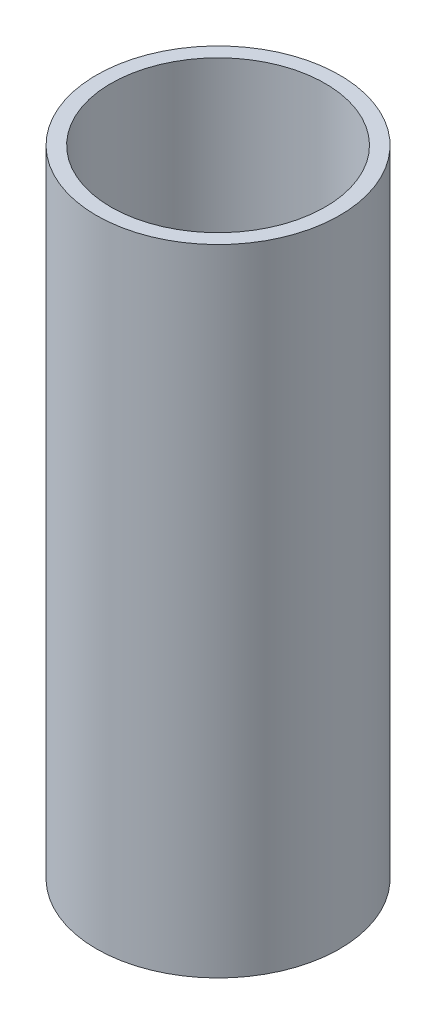
ISO-10303-21;
HEADER;
FILE_DESCRIPTION(('STEP AP214'),'2;1');
FILE_NAME('part.step','',(''),(''),'','','');
FILE_SCHEMA(('AUTOMOTIVE_DESIGN { 1 0 10303 214 1 1 1 1 }'));
ENDSEC;
DATA;
#1=APPLICATION_CONTEXT('core data for automotive mechanical design processes');
#2=APPLICATION_PROTOCOL_DEFINITION('international standard','automotive_design',2000,#1);
#3=PRODUCT_CONTEXT('',#1,'mechanical');
#4=PRODUCT('Part','Part','',(#3));
#5=PRODUCT_RELATED_PRODUCT_CATEGORY('part','',(#4));
#6=PRODUCT_DEFINITION_FORMATION('','',#4);
#7=PRODUCT_DEFINITION_CONTEXT('part definition',#1,'design');
#8=PRODUCT_DEFINITION('design','',#6,#7);
#9=PRODUCT_DEFINITION_SHAPE('','',#8);
#10=(LENGTH_UNIT() NAMED_UNIT(*) SI_UNIT(.MILLI.,.METRE.));
#11=(NAMED_UNIT(*) PLANE_ANGLE_UNIT() SI_UNIT($,.RADIAN.));
#12=(NAMED_UNIT(*) SI_UNIT($,.STERADIAN.) SOLID_ANGLE_UNIT());
#13=UNCERTAINTY_MEASURE_WITH_UNIT(LENGTH_MEASURE(1.E-05),#10,'distance_accuracy_value','');
#14=(GEOMETRIC_REPRESENTATION_CONTEXT(3) GLOBAL_UNCERTAINTY_ASSIGNED_CONTEXT((#13)) GLOBAL_UNIT_ASSIGNED_CONTEXT((#10,
#11,#12)) REPRESENTATION_CONTEXT('',''));
#15=CARTESIAN_POINT('',(0.,0.,0.));
#16=DIRECTION('',(0.,0.,1.));
#17=DIRECTION('',(1.,0.,0.));
#18=AXIS2_PLACEMENT_3D('',#15,#16,#17);
#19=CARTESIAN_POINT('',(0.,300.241473823942,0.));
#20=DIRECTION('',(0.,-1.,0.));
#21=DIRECTION('',(0.,0.,-1.));
#22=AXIS2_PLACEMENT_3D('',#19,#20,#21);
#23=CYLINDRICAL_SURFACE('',#22,57.5);
#24=CARTESIAN_POINT('',(0.,300.241473823942,0.));
#25=DIRECTION('',(0.,1.,0.));
#26=DIRECTION('',(0.,0.,1.));
#27=AXIS2_PLACEMENT_3D('',#24,#25,#26);
#28=CIRCLE('',#27,57.5);
#29=CARTESIAN_POINT('',(0.,300.241473823942,57.5));
#30=VERTEX_POINT('',#29);
#31=EDGE_CURVE('E10',#30,#30,#28,.T.);
#32=ORIENTED_EDGE('',*,*,#31,.F.);
#33=EDGE_LOOP('',(#32));
#34=FACE_BOUND('',#33,.T.);
#35=CARTESIAN_POINT('',(0.,0.,0.));
#36=DIRECTION('',(0.,1.,0.));
#37=DIRECTION('',(0.,0.,1.));
#38=AXIS2_PLACEMENT_3D('',#35,#36,#37);
#39=CIRCLE('',#38,57.5);
#40=CARTESIAN_POINT('',(0.,0.,57.5));
#41=VERTEX_POINT('',#40);
#42=EDGE_CURVE('E37',#41,#41,#39,.T.);
#43=ORIENTED_EDGE('',*,*,#42,.T.);
#44=EDGE_LOOP('',(#43));
#45=FACE_BOUND('',#44,.T.);
#46=ADVANCED_FACE('F40',(#34,#45),#23,.T.);
#47=CARTESIAN_POINT('',(0.,300.241473823942,0.));
#48=DIRECTION('',(0.,1.,0.));
#49=DIRECTION('',(0.,0.,1.));
#50=AXIS2_PLACEMENT_3D('',#47,#48,#49);
#51=PLANE('',#50);
#52=CARTESIAN_POINT('',(0.,300.241473823942,0.));
#53=DIRECTION('',(0.,1.,0.));
#54=DIRECTION('',(0.,0.,1.));
#55=AXIS2_PLACEMENT_3D('',#52,#53,#54);
#56=CIRCLE('',#55,50.6301188815059);
#57=CARTESIAN_POINT('',(0.,300.241473823942,50.6301188815059));
#58=VERTEX_POINT('',#57);
#59=EDGE_CURVE('E50',#58,#58,#56,.T.);
#60=ORIENTED_EDGE('',*,*,#59,.F.);
#61=EDGE_LOOP('',(#60));
#62=FACE_BOUND('',#61,.T.);
#63=ORIENTED_EDGE('',*,*,#31,.T.);
#64=EDGE_LOOP('',(#63));
#65=FACE_BOUND('',#64,.T.);
#66=ADVANCED_FACE('F59',(#62,#65),#51,.T.);
#67=CARTESIAN_POINT('',(0.,0.,0.));
#68=DIRECTION('',(0.,1.,0.));
#69=DIRECTION('',(0.,0.,1.));
#70=AXIS2_PLACEMENT_3D('',#67,#68,#69);
#71=PLANE('',#70);
#72=CARTESIAN_POINT('',(0.,0.,0.));
#73=DIRECTION('',(0.,1.,0.));
#74=DIRECTION('',(0.,0.,1.));
#75=AXIS2_PLACEMENT_3D('',#72,#73,#74);
#76=CIRCLE('',#75,50.6301188815059);
#77=CARTESIAN_POINT('',(0.,0.,50.6301188815059));
#78=VERTEX_POINT('',#77);
#79=EDGE_CURVE('E47',#78,#78,#76,.T.);
#80=ORIENTED_EDGE('',*,*,#79,.T.);
#81=EDGE_LOOP('',(#80));
#82=FACE_BOUND('',#81,.T.);
#83=ORIENTED_EDGE('',*,*,#42,.F.);
#84=EDGE_LOOP('',(#83));
#85=FACE_BOUND('',#84,.T.);
#86=ADVANCED_FACE('F58',(#82,#85),#71,.F.);
#87=CARTESIAN_POINT('',(0.,300.241473823942,0.));
#88=DIRECTION('',(0.,-1.,0.));
#89=DIRECTION('',(0.,0.,-1.));
#90=AXIS2_PLACEMENT_3D('',#87,#88,#89);
#91=CYLINDRICAL_SURFACE('',#90,50.6301188815059);
#92=ORIENTED_EDGE('',*,*,#59,.T.);
#93=EDGE_LOOP('',(#92));
#94=FACE_BOUND('',#93,.T.);
#95=ORIENTED_EDGE('',*,*,#79,.F.);
#96=EDGE_LOOP('',(#95));
#97=FACE_BOUND('',#96,.T.);
#98=ADVANCED_FACE('F54',(#94,#97),#91,.F.);
#99=CLOSED_SHELL('',(#46,#66,#86,#98));
#100=MANIFOLD_SOLID_BREP('B2',#99);
#101=ADVANCED_BREP_SHAPE_REPRESENTATION('',(#18,#100),#14);
#102=SHAPE_DEFINITION_REPRESENTATION(#9,#101);
ENDSEC;
END-ISO-10303-21;
